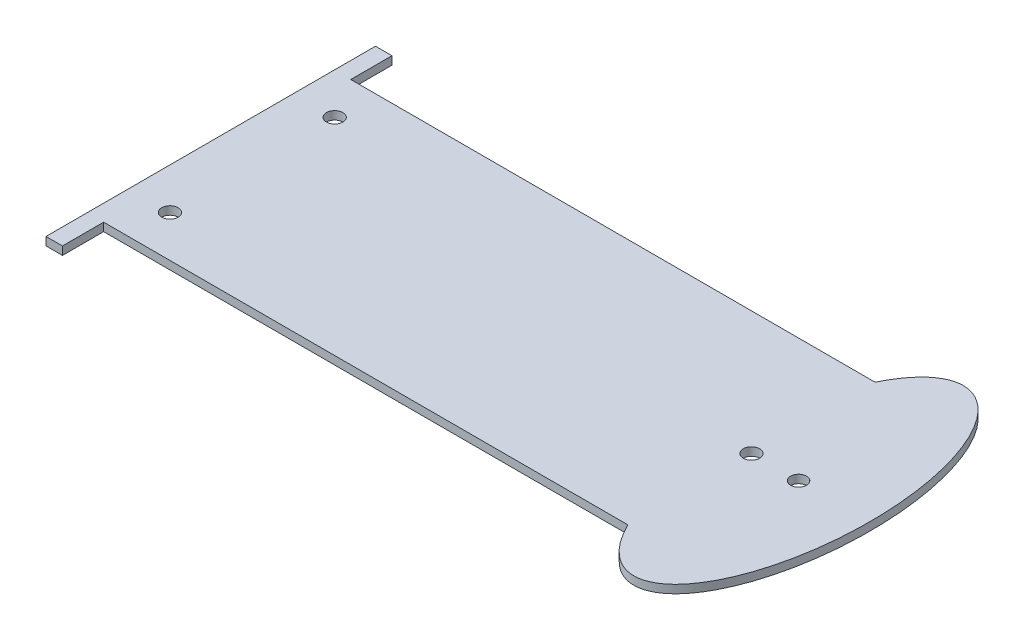
ISO-10303-21;
HEADER;
FILE_DESCRIPTION(('STEP AP214'),'2;1');
FILE_NAME('part.step','',(''),(''),'','','');
FILE_SCHEMA(('AUTOMOTIVE_DESIGN { 1 0 10303 214 1 1 1 1 }'));
ENDSEC;
DATA;
#1=APPLICATION_CONTEXT('core data for automotive mechanical design processes');
#2=APPLICATION_PROTOCOL_DEFINITION('international standard','automotive_design',2000,#1);
#3=PRODUCT_CONTEXT('',#1,'mechanical');
#4=PRODUCT('Part','Part','',(#3));
#5=PRODUCT_RELATED_PRODUCT_CATEGORY('part','',(#4));
#6=PRODUCT_DEFINITION_FORMATION('','',#4);
#7=PRODUCT_DEFINITION_CONTEXT('part definition',#1,'design');
#8=PRODUCT_DEFINITION('design','',#6,#7);
#9=PRODUCT_DEFINITION_SHAPE('','',#8);
#10=(LENGTH_UNIT() NAMED_UNIT(*) SI_UNIT(.MILLI.,.METRE.));
#11=(NAMED_UNIT(*) PLANE_ANGLE_UNIT() SI_UNIT($,.RADIAN.));
#12=(NAMED_UNIT(*) SI_UNIT($,.STERADIAN.) SOLID_ANGLE_UNIT());
#13=UNCERTAINTY_MEASURE_WITH_UNIT(LENGTH_MEASURE(1.E-05),#10,'distance_accuracy_value','');
#14=(GEOMETRIC_REPRESENTATION_CONTEXT(3) GLOBAL_UNCERTAINTY_ASSIGNED_CONTEXT((#13)) GLOBAL_UNIT_ASSIGNED_CONTEXT((#10,
#11,#12)) REPRESENTATION_CONTEXT('',''));
#15=CARTESIAN_POINT('',(0.,0.,0.));
#16=DIRECTION('',(0.,0.,1.));
#17=DIRECTION('',(1.,0.,0.));
#18=AXIS2_PLACEMENT_3D('',#15,#16,#17);
#19=CARTESIAN_POINT('',(0.,2.54,50.0124699151832));
#20=DIRECTION('',(0.,0.,-1.));
#21=DIRECTION('',(-1.,0.,0.));
#22=AXIS2_PLACEMENT_3D('',#19,#20,#21);
#23=PLANE('',#22);
#24=DIRECTION('',(1.,0.,0.));
#25=VECTOR('',#24,1.);
#26=CARTESIAN_POINT('',(0.,0.,50.0124699151832));
#27=LINE('',#26,#25);
#28=CARTESIAN_POINT('',(-83.0206993006994,0.,50.0124699151832));
#29=VERTEX_POINT('',#28);
#30=CARTESIAN_POINT('',(78.6272342190113,0.,50.0124699151832));
#31=VERTEX_POINT('',#30);
#32=EDGE_CURVE('E138',#29,#31,#27,.T.);
#33=ORIENTED_EDGE('',*,*,#32,.T.);
#34=DIRECTION('',(0.,-1.,0.));
#35=VECTOR('',#34,1.);
#36=CARTESIAN_POINT('',(78.6272342190113,2.54,50.0124699151832));
#37=LINE('',#36,#35);
#38=CARTESIAN_POINT('',(78.6272342190113,2.54,50.0124699151832));
#39=VERTEX_POINT('',#38);
#40=EDGE_CURVE('E11',#39,#31,#37,.T.);
#41=ORIENTED_EDGE('',*,*,#40,.F.);
#42=DIRECTION('',(1.,0.,0.));
#43=VECTOR('',#42,1.);
#44=CARTESIAN_POINT('',(0.,2.54,50.0124699151832));
#45=LINE('',#44,#43);
#46=CARTESIAN_POINT('',(-83.0206993006994,2.54,50.0124699151832));
#47=VERTEX_POINT('',#46);
#48=EDGE_CURVE('E159',#47,#39,#45,.T.);
#49=ORIENTED_EDGE('',*,*,#48,.F.);
#50=DIRECTION('',(0.,-1.,0.));
#51=VECTOR('',#50,1.);
#52=CARTESIAN_POINT('',(-83.0206993006994,2.54,50.0124699151832));
#53=LINE('',#52,#51);
#54=EDGE_CURVE('E56',#47,#29,#53,.T.);
#55=ORIENTED_EDGE('',*,*,#54,.T.);
#56=EDGE_LOOP('',(#33,#41,#49,#55));
#57=FACE_BOUND('',#56,.T.);
#58=ADVANCED_FACE('F40',(#57),#23,.F.);
#59=CARTESIAN_POINT('',(93.1491368348515,2.54,11.9099618474428));
#60=DIRECTION('',(0.,1.,0.));
#61=DIRECTION('',(0.000114261913464284,0.,-0.999999993472108));
#62=AXIS2_PLACEMENT_3D('',#59,#60,#61);
#63=ELLIPSE('',#62,50.8025083993737,21.9501640077375);
#64=DIRECTION('',(0.,-1.,0.));
#65=VECTOR('',#64,1.);
#66=SURFACE_OF_LINEAR_EXTRUSION('',#63,#65);
#67=CARTESIAN_POINT('',(93.1491368348515,0.,11.9099618474428));
#68=DIRECTION('',(0.,1.,0.));
#69=DIRECTION('',(0.000114261913464284,0.,-0.999999993472108));
#70=AXIS2_PLACEMENT_3D('',#67,#68,#69);
#71=ELLIPSE('',#70,50.8025083993737,21.9501640077375);
#72=CARTESIAN_POINT('',(78.6318583454493,0.,-26.1875300848168));
#73=VERTEX_POINT('',#72);
#74=EDGE_CURVE('E140',#31,#73,#71,.T.);
#75=ORIENTED_EDGE('',*,*,#74,.T.);
#76=DIRECTION('',(0.,-1.,0.));
#77=VECTOR('',#76,1.);
#78=CARTESIAN_POINT('',(78.6318583454493,2.54,-26.1875300848168));
#79=LINE('',#78,#77);
#80=CARTESIAN_POINT('',(78.6318583454493,2.54,-26.1875300848168));
#81=VERTEX_POINT('',#80);
#82=EDGE_CURVE('E48',#81,#73,#79,.T.);
#83=ORIENTED_EDGE('',*,*,#82,.F.);
#84=EDGE_CURVE('E95',#39,#81,#63,.T.);
#85=ORIENTED_EDGE('',*,*,#84,.F.);
#86=ORIENTED_EDGE('',*,*,#40,.T.);
#87=EDGE_LOOP('',(#75,#83,#85,#86));
#88=FACE_BOUND('',#87,.T.);
#89=ADVANCED_FACE('F172',(#88),#66,.F.);
#90=CARTESIAN_POINT('',(0.,2.54,-26.1875300848168));
#91=DIRECTION('',(0.,0.,-1.));
#92=DIRECTION('',(-1.,0.,0.));
#93=AXIS2_PLACEMENT_3D('',#90,#91,#92);
#94=PLANE('',#93);
#95=DIRECTION('',(1.,0.,0.));
#96=VECTOR('',#95,1.);
#97=CARTESIAN_POINT('',(0.,0.,-26.1875300848168));
#98=LINE('',#97,#96);
#99=CARTESIAN_POINT('',(-83.0206993006993,0.,-26.1875300848168));
#100=VERTEX_POINT('',#99);
#101=EDGE_CURVE('E144',#100,#73,#98,.T.);
#102=ORIENTED_EDGE('',*,*,#101,.F.);
#103=DIRECTION('',(0.,-1.,0.));
#104=VECTOR('',#103,1.);
#105=CARTESIAN_POINT('',(-83.0206993006993,2.54,-26.1875300848168));
#106=LINE('',#105,#104);
#107=CARTESIAN_POINT('',(-83.0206993006993,2.54,-26.1875300848168));
#108=VERTEX_POINT('',#107);
#109=EDGE_CURVE('E165',#108,#100,#106,.T.);
#110=ORIENTED_EDGE('',*,*,#109,.F.);
#111=DIRECTION('',(1.,0.,0.));
#112=VECTOR('',#111,1.);
#113=CARTESIAN_POINT('',(0.,2.54,-26.1875300848168));
#114=LINE('',#113,#112);
#115=EDGE_CURVE('E171',#108,#81,#114,.T.);
#116=ORIENTED_EDGE('',*,*,#115,.T.);
#117=ORIENTED_EDGE('',*,*,#82,.T.);
#118=EDGE_LOOP('',(#102,#110,#116,#117));
#119=FACE_BOUND('',#118,.T.);
#120=ADVANCED_FACE('F169',(#119),#94,.T.);
#121=CARTESIAN_POINT('',(-83.0206993006993,2.54,0.));
#122=DIRECTION('',(-1.,0.,0.));
#123=DIRECTION('',(0.,0.,1.));
#124=AXIS2_PLACEMENT_3D('',#121,#122,#123);
#125=PLANE('',#124);
#126=DIRECTION('',(0.,0.,-1.));
#127=VECTOR('',#126,1.);
#128=CARTESIAN_POINT('',(-83.0206993006993,0.,0.));
#129=LINE('',#128,#127);
#130=CARTESIAN_POINT('',(-83.0206993006993,0.,-38.8875300848168));
#131=VERTEX_POINT('',#130);
#132=EDGE_CURVE('E147',#100,#131,#129,.T.);
#133=ORIENTED_EDGE('',*,*,#132,.T.);
#134=DIRECTION('',(0.,-1.,0.));
#135=VECTOR('',#134,1.);
#136=CARTESIAN_POINT('',(-83.0206993006993,2.54,-38.8875300848168));
#137=LINE('',#136,#135);
#138=CARTESIAN_POINT('',(-83.0206993006993,2.54,-38.8875300848168));
#139=VERTEX_POINT('',#138);
#140=EDGE_CURVE('E163',#139,#131,#137,.T.);
#141=ORIENTED_EDGE('',*,*,#140,.F.);
#142=DIRECTION('',(0.,0.,-1.));
#143=VECTOR('',#142,1.);
#144=CARTESIAN_POINT('',(-83.0206993006993,2.54,0.));
#145=LINE('',#144,#143);
#146=EDGE_CURVE('E133',#108,#139,#145,.T.);
#147=ORIENTED_EDGE('',*,*,#146,.F.);
#148=ORIENTED_EDGE('',*,*,#109,.T.);
#149=EDGE_LOOP('',(#133,#141,#147,#148));
#150=FACE_BOUND('',#149,.T.);
#151=ADVANCED_FACE('F180',(#150),#125,.F.);
#152=CARTESIAN_POINT('',(0.,2.54,-38.8875300848168));
#153=DIRECTION('',(0.,0.,-1.));
#154=DIRECTION('',(-1.,0.,0.));
#155=AXIS2_PLACEMENT_3D('',#152,#153,#154);
#156=PLANE('',#155);
#157=DIRECTION('',(1.,0.,0.));
#158=VECTOR('',#157,1.);
#159=CARTESIAN_POINT('',(0.,0.,-38.8875300848168));
#160=LINE('',#159,#158);
#161=CARTESIAN_POINT('',(-88.1006993006993,0.,-38.8875300848168));
#162=VERTEX_POINT('',#161);
#163=EDGE_CURVE('E150',#162,#131,#160,.T.);
#164=ORIENTED_EDGE('',*,*,#163,.F.);
#165=DIRECTION('',(0.,-1.,0.));
#166=VECTOR('',#165,1.);
#167=CARTESIAN_POINT('',(-88.1006993006993,2.54,-38.8875300848168));
#168=LINE('',#167,#166);
#169=CARTESIAN_POINT('',(-88.1006993006993,2.54,-38.8875300848168));
#170=VERTEX_POINT('',#169);
#171=EDGE_CURVE('E120',#170,#162,#168,.T.);
#172=ORIENTED_EDGE('',*,*,#171,.F.);
#173=DIRECTION('',(1.,0.,0.));
#174=VECTOR('',#173,1.);
#175=CARTESIAN_POINT('',(0.,2.54,-38.8875300848168));
#176=LINE('',#175,#174);
#177=EDGE_CURVE('E131',#170,#139,#176,.T.);
#178=ORIENTED_EDGE('',*,*,#177,.T.);
#179=ORIENTED_EDGE('',*,*,#140,.T.);
#180=EDGE_LOOP('',(#164,#172,#178,#179));
#181=FACE_BOUND('',#180,.T.);
#182=ADVANCED_FACE('F193',(#181),#156,.T.);
#183=CARTESIAN_POINT('',(-88.1006993006993,2.54,0.));
#184=DIRECTION('',(-1.,0.,0.));
#185=DIRECTION('',(0.,0.,1.));
#186=AXIS2_PLACEMENT_3D('',#183,#184,#185);
#187=PLANE('',#186);
#188=DIRECTION('',(0.,0.,-1.));
#189=VECTOR('',#188,1.);
#190=CARTESIAN_POINT('',(-88.1006993006993,0.,0.));
#191=LINE('',#190,#189);
#192=CARTESIAN_POINT('',(-88.1006993006993,0.,62.7124699151832));
#193=VERTEX_POINT('',#192);
#194=EDGE_CURVE('E117',#193,#162,#191,.T.);
#195=ORIENTED_EDGE('',*,*,#194,.F.);
#196=DIRECTION('',(0.,-1.,0.));
#197=VECTOR('',#196,1.);
#198=CARTESIAN_POINT('',(-88.1006993006993,2.54,62.7124699151832));
#199=LINE('',#198,#197);
#200=CARTESIAN_POINT('',(-88.1006993006993,2.54,62.7124699151832));
#201=VERTEX_POINT('',#200);
#202=EDGE_CURVE('E111',#201,#193,#199,.T.);
#203=ORIENTED_EDGE('',*,*,#202,.F.);
#204=DIRECTION('',(0.,0.,-1.));
#205=VECTOR('',#204,1.);
#206=CARTESIAN_POINT('',(-88.1006993006993,2.54,0.));
#207=LINE('',#206,#205);
#208=EDGE_CURVE('E115',#201,#170,#207,.T.);
#209=ORIENTED_EDGE('',*,*,#208,.T.);
#210=ORIENTED_EDGE('',*,*,#171,.T.);
#211=EDGE_LOOP('',(#195,#203,#209,#210));
#212=FACE_BOUND('',#211,.T.);
#213=ADVANCED_FACE('F113',(#212),#187,.T.);
#214=CARTESIAN_POINT('',(0.,2.54,62.7124699151832));
#215=DIRECTION('',(0.,0.,-1.));
#216=DIRECTION('',(-1.,0.,0.));
#217=AXIS2_PLACEMENT_3D('',#214,#215,#216);
#218=PLANE('',#217);
#219=DIRECTION('',(1.,0.,0.));
#220=VECTOR('',#219,1.);
#221=CARTESIAN_POINT('',(0.,0.,62.7124699151832));
#222=LINE('',#221,#220);
#223=CARTESIAN_POINT('',(-83.0206993006993,0.,62.7124699151832));
#224=VERTEX_POINT('',#223);
#225=EDGE_CURVE('E154',#193,#224,#222,.T.);
#226=ORIENTED_EDGE('',*,*,#225,.T.);
#227=DIRECTION('',(0.,-1.,0.));
#228=VECTOR('',#227,1.);
#229=CARTESIAN_POINT('',(-83.0206993006993,2.54,62.7124699151832));
#230=LINE('',#229,#228);
#231=CARTESIAN_POINT('',(-83.0206993006993,2.54,62.7124699151832));
#232=VERTEX_POINT('',#231);
#233=EDGE_CURVE('E83',#232,#224,#230,.T.);
#234=ORIENTED_EDGE('',*,*,#233,.F.);
#235=DIRECTION('',(1.,0.,0.));
#236=VECTOR('',#235,1.);
#237=CARTESIAN_POINT('',(0.,2.54,62.7124699151832));
#238=LINE('',#237,#236);
#239=EDGE_CURVE('E122',#201,#232,#238,.T.);
#240=ORIENTED_EDGE('',*,*,#239,.F.);
#241=ORIENTED_EDGE('',*,*,#202,.T.);
#242=EDGE_LOOP('',(#226,#234,#240,#241));
#243=FACE_BOUND('',#242,.T.);
#244=ADVANCED_FACE('F123',(#243),#218,.F.);
#245=CARTESIAN_POINT('',(-83.0206993006995,2.54,1.81439944653776E-13));
#246=DIRECTION('',(1.,0.,0.));
#247=DIRECTION('',(0.,0.,-1.));
#248=AXIS2_PLACEMENT_3D('',#245,#246,#247);
#249=PLANE('',#248);
#250=DIRECTION('',(0.,0.,1.));
#251=VECTOR('',#250,1.);
#252=CARTESIAN_POINT('',(-83.0206993006995,0.,1.81439944653776E-13));
#253=LINE('',#252,#251);
#254=EDGE_CURVE('E156',#29,#224,#253,.T.);
#255=ORIENTED_EDGE('',*,*,#254,.F.);
#256=ORIENTED_EDGE('',*,*,#54,.F.);
#257=DIRECTION('',(0.,0.,1.));
#258=VECTOR('',#257,1.);
#259=CARTESIAN_POINT('',(-83.0206993006995,2.54,1.81439944653776E-13));
#260=LINE('',#259,#258);
#261=EDGE_CURVE('E126',#47,#232,#260,.T.);
#262=ORIENTED_EDGE('',*,*,#261,.T.);
#263=ORIENTED_EDGE('',*,*,#233,.T.);
#264=EDGE_LOOP('',(#255,#256,#262,#263));
#265=FACE_BOUND('',#264,.T.);
#266=ADVANCED_FACE('F201',(#265),#249,.T.);
#267=CARTESIAN_POINT('',(0.,2.54,0.));
#268=DIRECTION('',(0.,1.,0.));
#269=DIRECTION('',(0.,0.,1.));
#270=AXIS2_PLACEMENT_3D('',#267,#268,#269);
#271=PLANE('',#270);
#272=CARTESIAN_POINT('',(-75.4035433294448,2.54,-13.6003371034402));
#273=DIRECTION('',(0.,1.,0.));
#274=DIRECTION('',(0.,0.,1.));
#275=AXIS2_PLACEMENT_3D('',#272,#273,#274);
#276=CIRCLE('',#275,2.54);
#277=CARTESIAN_POINT('',(-75.4035433294448,2.54,-11.0603371034402));
#278=VERTEX_POINT('',#277);
#279=EDGE_CURVE('E321',#278,#278,#276,.T.);
#280=ORIENTED_EDGE('',*,*,#279,.F.);
#281=EDGE_LOOP('',(#280));
#282=FACE_BOUND('',#281,.T.);
#283=CARTESIAN_POINT('',(-75.4035433294448,2.54,37.2012882751422));
#284=DIRECTION('',(0.,1.,0.));
#285=DIRECTION('',(0.,0.,1.));
#286=AXIS2_PLACEMENT_3D('',#283,#284,#285);
#287=CIRCLE('',#286,2.54);
#288=CARTESIAN_POINT('',(-75.4035433294448,2.54,39.7412882751422));
#289=VERTEX_POINT('',#288);
#290=EDGE_CURVE('E322',#289,#289,#287,.T.);
#291=ORIENTED_EDGE('',*,*,#290,.F.);
#292=EDGE_LOOP('',(#291));
#293=FACE_BOUND('',#292,.T.);
#294=CARTESIAN_POINT('',(78.6295462822303,2.54,11.9124699151832));
#295=DIRECTION('',(0.,1.,0.));
#296=DIRECTION('',(0.,0.,1.));
#297=AXIS2_PLACEMENT_3D('',#294,#295,#296);
#298=CIRCLE('',#297,2.54);
#299=CARTESIAN_POINT('',(78.6295462822303,2.54,14.4524699151832));
#300=VERTEX_POINT('',#299);
#301=EDGE_CURVE('E331',#300,#300,#298,.T.);
#302=ORIENTED_EDGE('',*,*,#301,.F.);
#303=EDGE_LOOP('',(#302));
#304=FACE_BOUND('',#303,.T.);
#305=CARTESIAN_POINT('',(93.1491368348515,2.54,11.9099618474428));
#306=DIRECTION('',(0.,1.,0.));
#307=DIRECTION('',(0.,0.,1.));
#308=AXIS2_PLACEMENT_3D('',#305,#306,#307);
#309=CIRCLE('',#308,2.4472718602487);
#310=CARTESIAN_POINT('',(93.1491368348515,2.54,14.3572337076915));
#311=VERTEX_POINT('',#310);
#312=EDGE_CURVE('E337',#311,#311,#309,.T.);
#313=ORIENTED_EDGE('',*,*,#312,.F.);
#314=EDGE_LOOP('',(#313));
#315=FACE_BOUND('',#314,.T.);
#316=ORIENTED_EDGE('',*,*,#48,.T.);
#317=ORIENTED_EDGE('',*,*,#84,.T.);
#318=ORIENTED_EDGE('',*,*,#115,.F.);
#319=ORIENTED_EDGE('',*,*,#146,.T.);
#320=ORIENTED_EDGE('',*,*,#177,.F.);
#321=ORIENTED_EDGE('',*,*,#208,.F.);
#322=ORIENTED_EDGE('',*,*,#239,.T.);
#323=ORIENTED_EDGE('',*,*,#261,.F.);
#324=EDGE_LOOP('',(#316,#317,#318,#319,#320,#321,#322,#323));
#325=FACE_BOUND('',#324,.T.);
#326=ADVANCED_FACE('F129',(#282,#293,#304,#315,#325),#271,.T.);
#327=CARTESIAN_POINT('',(0.,0.,0.));
#328=DIRECTION('',(0.,1.,0.));
#329=DIRECTION('',(0.,0.,1.));
#330=AXIS2_PLACEMENT_3D('',#327,#328,#329);
#331=PLANE('',#330);
#332=CARTESIAN_POINT('',(-75.4035433294448,0.,-13.6003371034402));
#333=DIRECTION('',(0.,1.,0.));
#334=DIRECTION('',(0.,0.,1.));
#335=AXIS2_PLACEMENT_3D('',#332,#333,#334);
#336=CIRCLE('',#335,2.54);
#337=CARTESIAN_POINT('',(-75.4035433294448,0.,-11.0603371034402));
#338=VERTEX_POINT('',#337);
#339=EDGE_CURVE('E141',#338,#338,#336,.T.);
#340=ORIENTED_EDGE('',*,*,#339,.T.);
#341=EDGE_LOOP('',(#340));
#342=FACE_BOUND('',#341,.T.);
#343=CARTESIAN_POINT('',(-75.4035433294448,0.,37.2012882751422));
#344=DIRECTION('',(0.,1.,0.));
#345=DIRECTION('',(0.,0.,1.));
#346=AXIS2_PLACEMENT_3D('',#343,#344,#345);
#347=CIRCLE('',#346,2.54);
#348=CARTESIAN_POINT('',(-75.4035433294448,0.,39.7412882751422));
#349=VERTEX_POINT('',#348);
#350=EDGE_CURVE('E326',#349,#349,#347,.T.);
#351=ORIENTED_EDGE('',*,*,#350,.T.);
#352=EDGE_LOOP('',(#351));
#353=FACE_BOUND('',#352,.T.);
#354=CARTESIAN_POINT('',(78.6295462822303,0.,11.9124699151832));
#355=DIRECTION('',(0.,1.,0.));
#356=DIRECTION('',(0.,0.,1.));
#357=AXIS2_PLACEMENT_3D('',#354,#355,#356);
#358=CIRCLE('',#357,2.54);
#359=CARTESIAN_POINT('',(78.6295462822303,0.,14.4524699151832));
#360=VERTEX_POINT('',#359);
#361=EDGE_CURVE('E334',#360,#360,#358,.T.);
#362=ORIENTED_EDGE('',*,*,#361,.T.);
#363=EDGE_LOOP('',(#362));
#364=FACE_BOUND('',#363,.T.);
#365=CARTESIAN_POINT('',(93.1491368348515,0.,11.9099618474428));
#366=DIRECTION('',(0.,1.,0.));
#367=DIRECTION('',(0.,0.,1.));
#368=AXIS2_PLACEMENT_3D('',#365,#366,#367);
#369=CIRCLE('',#368,2.4472718602487);
#370=CARTESIAN_POINT('',(93.1491368348515,0.,14.3572337076915));
#371=VERTEX_POINT('',#370);
#372=EDGE_CURVE('E339',#371,#371,#369,.T.);
#373=ORIENTED_EDGE('',*,*,#372,.T.);
#374=EDGE_LOOP('',(#373));
#375=FACE_BOUND('',#374,.T.);
#376=ORIENTED_EDGE('',*,*,#32,.F.);
#377=ORIENTED_EDGE('',*,*,#254,.T.);
#378=ORIENTED_EDGE('',*,*,#225,.F.);
#379=ORIENTED_EDGE('',*,*,#194,.T.);
#380=ORIENTED_EDGE('',*,*,#163,.T.);
#381=ORIENTED_EDGE('',*,*,#132,.F.);
#382=ORIENTED_EDGE('',*,*,#101,.T.);
#383=ORIENTED_EDGE('',*,*,#74,.F.);
#384=EDGE_LOOP('',(#376,#377,#378,#379,#380,#381,#382,#383));
#385=FACE_BOUND('',#384,.T.);
#386=ADVANCED_FACE('F176',(#342,#353,#364,#375,#385),#331,.F.);
#387=CARTESIAN_POINT('',(93.1491368348515,0.,11.9099618474428));
#388=DIRECTION('',(0.,1.,0.));
#389=DIRECTION('',(0.,0.,1.));
#390=AXIS2_PLACEMENT_3D('',#387,#388,#389);
#391=CYLINDRICAL_SURFACE('',#390,2.4472718602487);
#392=ORIENTED_EDGE('',*,*,#372,.F.);
#393=EDGE_LOOP('',(#392));
#394=FACE_BOUND('',#393,.T.);
#395=ORIENTED_EDGE('',*,*,#312,.T.);
#396=EDGE_LOOP('',(#395));
#397=FACE_BOUND('',#396,.T.);
#398=ADVANCED_FACE('F206',(#394,#397),#391,.F.);
#399=CARTESIAN_POINT('',(78.6295462822303,0.,11.9124699151832));
#400=DIRECTION('',(0.,1.,0.));
#401=DIRECTION('',(0.,0.,1.));
#402=AXIS2_PLACEMENT_3D('',#399,#400,#401);
#403=CYLINDRICAL_SURFACE('',#402,2.54);
#404=ORIENTED_EDGE('',*,*,#361,.F.);
#405=EDGE_LOOP('',(#404));
#406=FACE_BOUND('',#405,.T.);
#407=ORIENTED_EDGE('',*,*,#301,.T.);
#408=EDGE_LOOP('',(#407));
#409=FACE_BOUND('',#408,.T.);
#410=ADVANCED_FACE('F213',(#406,#409),#403,.F.);
#411=CARTESIAN_POINT('',(-75.4035433294448,0.,37.2012882751422));
#412=DIRECTION('',(0.,1.,0.));
#413=DIRECTION('',(0.,0.,1.));
#414=AXIS2_PLACEMENT_3D('',#411,#412,#413);
#415=CYLINDRICAL_SURFACE('',#414,2.54);
#416=ORIENTED_EDGE('',*,*,#350,.F.);
#417=EDGE_LOOP('',(#416));
#418=FACE_BOUND('',#417,.T.);
#419=ORIENTED_EDGE('',*,*,#290,.T.);
#420=EDGE_LOOP('',(#419));
#421=FACE_BOUND('',#420,.T.);
#422=ADVANCED_FACE('F217',(#418,#421),#415,.F.);
#423=CARTESIAN_POINT('',(-75.4035433294448,0.,-13.6003371034402));
#424=DIRECTION('',(0.,1.,0.));
#425=DIRECTION('',(0.,0.,1.));
#426=AXIS2_PLACEMENT_3D('',#423,#424,#425);
#427=CYLINDRICAL_SURFACE('',#426,2.54);
#428=ORIENTED_EDGE('',*,*,#339,.F.);
#429=EDGE_LOOP('',(#428));
#430=FACE_BOUND('',#429,.T.);
#431=ORIENTED_EDGE('',*,*,#279,.T.);
#432=EDGE_LOOP('',(#431));
#433=FACE_BOUND('',#432,.T.);
#434=ADVANCED_FACE('F221',(#430,#433),#427,.F.);
#435=CLOSED_SHELL('',(#58,#89,#120,#151,#182,#213,#244,#266,#326,#386,#398,#410,#422,#434));
#436=MANIFOLD_SOLID_BREP('B2',#435);
#437=ADVANCED_BREP_SHAPE_REPRESENTATION('',(#18,#436),#14);
#438=SHAPE_DEFINITION_REPRESENTATION(#9,#437);
ENDSEC;
END-ISO-10303-21;
